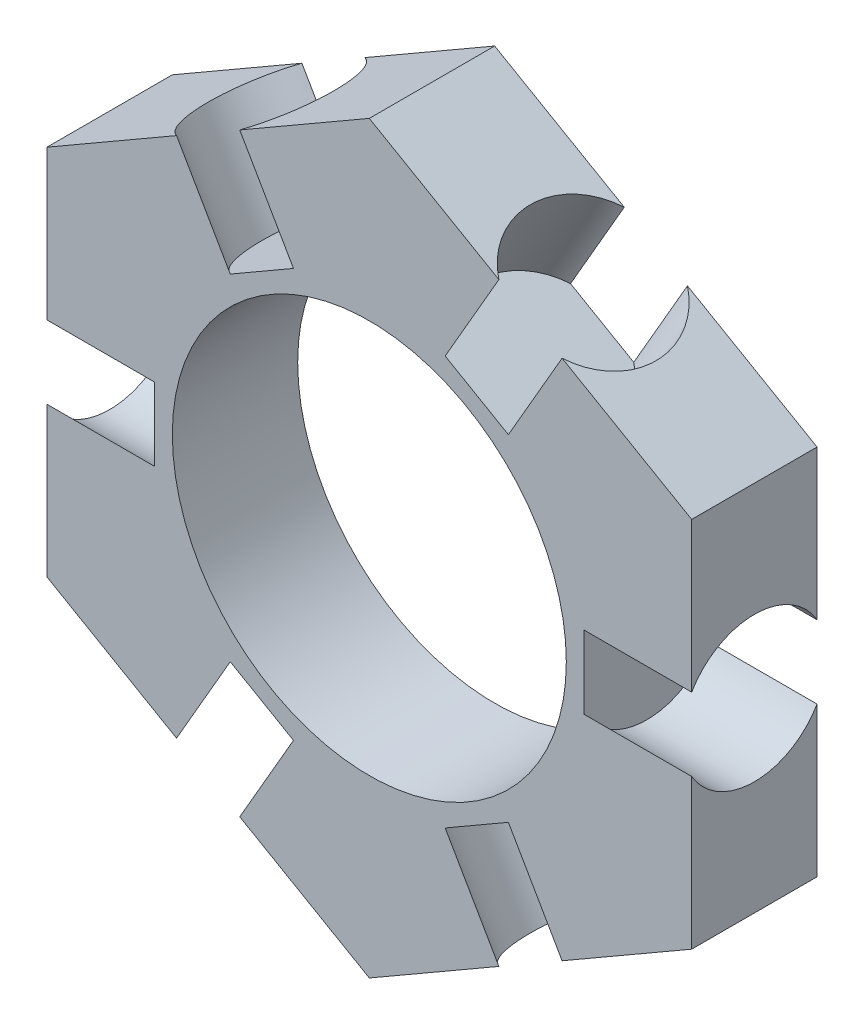
ISO-10303-21;
HEADER;
FILE_DESCRIPTION(('STEP AP214'),'2;1');
FILE_NAME('part.step','',(''),(''),'','','');
FILE_SCHEMA(('AUTOMOTIVE_DESIGN { 1 0 10303 214 1 1 1 1 }'));
ENDSEC;
DATA;
#1=APPLICATION_CONTEXT('core data for automotive mechanical design processes');
#2=APPLICATION_PROTOCOL_DEFINITION('international standard','automotive_design',2000,#1);
#3=PRODUCT_CONTEXT('',#1,'mechanical');
#4=PRODUCT('Part','Part','',(#3));
#5=PRODUCT_RELATED_PRODUCT_CATEGORY('part','',(#4));
#6=PRODUCT_DEFINITION_FORMATION('','',#4);
#7=PRODUCT_DEFINITION_CONTEXT('part definition',#1,'design');
#8=PRODUCT_DEFINITION('design','',#6,#7);
#9=PRODUCT_DEFINITION_SHAPE('','',#8);
#10=(LENGTH_UNIT() NAMED_UNIT(*) SI_UNIT(.MILLI.,.METRE.));
#11=(NAMED_UNIT(*) PLANE_ANGLE_UNIT() SI_UNIT($,.RADIAN.));
#12=(NAMED_UNIT(*) SI_UNIT($,.STERADIAN.) SOLID_ANGLE_UNIT());
#13=UNCERTAINTY_MEASURE_WITH_UNIT(LENGTH_MEASURE(1.E-05),#10,'distance_accuracy_value','');
#14=(GEOMETRIC_REPRESENTATION_CONTEXT(3) GLOBAL_UNCERTAINTY_ASSIGNED_CONTEXT((#13)) GLOBAL_UNIT_ASSIGNED_CONTEXT((#10,
#11,#12)) REPRESENTATION_CONTEXT('',''));
#15=CARTESIAN_POINT('',(0.,0.,0.));
#16=DIRECTION('',(0.,0.,1.));
#17=DIRECTION('',(1.,0.,0.));
#18=AXIS2_PLACEMENT_3D('',#15,#16,#17);
#19=CARTESIAN_POINT('',(0.,0.,3.5));
#20=DIRECTION('',(0.,0.,1.));
#21=DIRECTION('',(1.,0.,0.));
#22=AXIS2_PLACEMENT_3D('',#19,#20,#21);
#23=PLANE('',#22);
#24=CARTESIAN_POINT('',(0.,0.,3.5));
#25=DIRECTION('',(0.,0.,1.));
#26=DIRECTION('',(1.,0.,0.));
#27=AXIS2_PLACEMENT_3D('',#24,#25,#26);
#28=CIRCLE('',#27,11.);
#29=CARTESIAN_POINT('',(11.,0.,3.5));
#30=VERTEX_POINT('',#29);
#31=EDGE_CURVE('E364',#30,#30,#28,.T.);
#32=ORIENTED_EDGE('',*,*,#31,.F.);
#33=EDGE_LOOP('',(#32));
#34=FACE_BOUND('',#33,.T.);
#35=DIRECTION('',(0.866025403784439,0.5,0.));
#36=VECTOR('',#35,1.);
#37=CARTESIAN_POINT('',(0.,-20.7846096908265,3.5));
#38=LINE('',#37,#36);
#39=CARTESIAN_POINT('',(0.,-20.7846096908265,3.5));
#40=VERTEX_POINT('',#39);
#41=CARTESIAN_POINT('',(7.23524080962875,-16.6073414617356,3.5));
#42=VERTEX_POINT('',#41);
#43=EDGE_CURVE('E372',#40,#42,#38,.T.);
#44=ORIENTED_EDGE('',*,*,#43,.T.);
#45=DIRECTION('',(0.500000000000002,-0.866025403784437,0.));
#46=VECTOR('',#45,1.);
#47=CARTESIAN_POINT('',(4.23524080962874,-11.411189039029,3.5));
#48=LINE('',#47,#46);
#49=CARTESIAN_POINT('',(4.23524080962874,-11.411189039029,3.5));
#50=VERTEX_POINT('',#49);
#51=EDGE_CURVE('E61',#42,#50,#48,.F.);
#52=ORIENTED_EDGE('',*,*,#51,.T.);
#53=DIRECTION('',(-0.866025403784437,-0.500000000000002,0.));
#54=VECTOR('',#53,1.);
#55=CARTESIAN_POINT('',(6.00000000000003,-10.3923048454133,3.5));
#56=LINE('',#55,#54);
#57=CARTESIAN_POINT('',(7.76475919037136,-9.3734206517975,3.5));
#58=VERTEX_POINT('',#57);
#59=EDGE_CURVE('E338',#58,#50,#56,.T.);
#60=ORIENTED_EDGE('',*,*,#59,.F.);
#61=DIRECTION('',(0.500000000000002,-0.866025403784437,0.));
#62=VECTOR('',#61,1.);
#63=CARTESIAN_POINT('',(7.76475919037136,-9.3734206517975,3.5));
#64=LINE('',#63,#62);
#65=CARTESIAN_POINT('',(10.7647591903714,-14.5695730745041,3.5));
#66=VERTEX_POINT('',#65);
#67=EDGE_CURVE('E324',#58,#66,#64,.T.);
#68=ORIENTED_EDGE('',*,*,#67,.T.);
#69=CARTESIAN_POINT('',(18.,-10.3923048454133,3.5));
#70=VERTEX_POINT('',#69);
#71=EDGE_CURVE('E376',#66,#70,#38,.T.);
#72=ORIENTED_EDGE('',*,*,#71,.T.);
#73=DIRECTION('',(0.,1.,0.));
#74=VECTOR('',#73,1.);
#75=CARTESIAN_POINT('',(18.,-10.3923048454133,3.5));
#76=LINE('',#75,#74);
#77=CARTESIAN_POINT('',(18.,-2.03776838723137,3.5));
#78=VERTEX_POINT('',#77);
#79=EDGE_CURVE('E377',#70,#78,#76,.T.);
#80=ORIENTED_EDGE('',*,*,#79,.T.);
#81=DIRECTION('',(1.,0.,0.));
#82=VECTOR('',#81,1.);
#83=CARTESIAN_POINT('',(12.,-2.0377683872314,3.5));
#84=LINE('',#83,#82);
#85=CARTESIAN_POINT('',(12.,-2.0377683872314,3.5));
#86=VERTEX_POINT('',#85);
#87=EDGE_CURVE('E69',#78,#86,#84,.F.);
#88=ORIENTED_EDGE('',*,*,#87,.T.);
#89=DIRECTION('',(0.,-1.,0.));
#90=VECTOR('',#89,1.);
#91=CARTESIAN_POINT('',(12.,0.,3.5));
#92=LINE('',#91,#90);
#93=CARTESIAN_POINT('',(12.,2.03776838723156,3.5));
#94=VERTEX_POINT('',#93);
#95=EDGE_CURVE('E335',#94,#86,#92,.T.);
#96=ORIENTED_EDGE('',*,*,#95,.F.);
#97=DIRECTION('',(1.,0.,0.));
#98=VECTOR('',#97,1.);
#99=CARTESIAN_POINT('',(12.,2.03776838723157,3.5));
#100=LINE('',#99,#98);
#101=CARTESIAN_POINT('',(18.,2.0377683872316,3.5));
#102=VERTEX_POINT('',#101);
#103=EDGE_CURVE('E312',#94,#102,#100,.T.);
#104=ORIENTED_EDGE('',*,*,#103,.T.);
#105=CARTESIAN_POINT('',(18.,10.3923048454133,3.5));
#106=VERTEX_POINT('',#105);
#107=EDGE_CURVE('E375',#102,#106,#76,.T.);
#108=ORIENTED_EDGE('',*,*,#107,.T.);
#109=DIRECTION('',(-0.866025403784439,0.5,0.));
#110=VECTOR('',#109,1.);
#111=CARTESIAN_POINT('',(18.,10.3923048454133,3.5));
#112=LINE('',#111,#110);
#113=CARTESIAN_POINT('',(10.7647591903713,14.5695730745042,3.5));
#114=VERTEX_POINT('',#113);
#115=EDGE_CURVE('E382',#106,#114,#112,.T.);
#116=ORIENTED_EDGE('',*,*,#115,.T.);
#117=DIRECTION('',(0.5,0.866025403784439,0.));
#118=VECTOR('',#117,1.);
#119=CARTESIAN_POINT('',(7.76475919037129,9.37342065179754,3.5));
#120=LINE('',#119,#118);
#121=CARTESIAN_POINT('',(7.76475919037129,9.37342065179754,3.5));
#122=VERTEX_POINT('',#121);
#123=EDGE_CURVE('E302',#114,#122,#120,.F.);
#124=ORIENTED_EDGE('',*,*,#123,.T.);
#125=DIRECTION('',(0.866025403784439,-0.5,0.));
#126=VECTOR('',#125,1.);
#127=CARTESIAN_POINT('',(6.,10.3923048454133,3.5));
#128=LINE('',#127,#126);
#129=CARTESIAN_POINT('',(4.23524080962867,11.411189039029,3.5));
#130=VERTEX_POINT('',#129);
#131=EDGE_CURVE('E332',#130,#122,#128,.T.);
#132=ORIENTED_EDGE('',*,*,#131,.F.);
#133=DIRECTION('',(0.5,0.866025403784439,0.));
#134=VECTOR('',#133,1.);
#135=CARTESIAN_POINT('',(4.23524080962867,11.411189039029,3.5));
#136=LINE('',#135,#134);
#137=CARTESIAN_POINT('',(7.23524080962867,16.6073414617357,3.5));
#138=VERTEX_POINT('',#137);
#139=EDGE_CURVE('E298',#130,#138,#136,.T.);
#140=ORIENTED_EDGE('',*,*,#139,.T.);
#141=CARTESIAN_POINT('',(0.,20.7846096908265,3.5));
#142=VERTEX_POINT('',#141);
#143=EDGE_CURVE('E381',#138,#142,#112,.T.);
#144=ORIENTED_EDGE('',*,*,#143,.T.);
#145=DIRECTION('',(-0.866025403784439,-0.5,0.));
#146=VECTOR('',#145,1.);
#147=CARTESIAN_POINT('',(0.,20.7846096908265,3.5));
#148=LINE('',#147,#146);
#149=CARTESIAN_POINT('',(-7.23524080962886,16.6073414617355,3.5));
#150=VERTEX_POINT('',#149);
#151=EDGE_CURVE('E387',#142,#150,#148,.T.);
#152=ORIENTED_EDGE('',*,*,#151,.T.);
#153=DIRECTION('',(-0.500000000000008,0.866025403784434,0.));
#154=VECTOR('',#153,1.);
#155=CARTESIAN_POINT('',(-4.23524080962882,11.411189039029,3.5));
#156=LINE('',#155,#154);
#157=CARTESIAN_POINT('',(-4.23524080962882,11.411189039029,3.5));
#158=VERTEX_POINT('',#157);
#159=EDGE_CURVE('E288',#150,#158,#156,.F.);
#160=ORIENTED_EDGE('',*,*,#159,.T.);
#161=DIRECTION('',(0.866025403784434,0.500000000000008,0.));
#162=VECTOR('',#161,1.);
#163=CARTESIAN_POINT('',(-6.0000000000001,10.3923048454132,3.5));
#164=LINE('',#163,#162);
#165=CARTESIAN_POINT('',(-7.76475919037142,9.37342065179744,3.5));
#166=VERTEX_POINT('',#165);
#167=EDGE_CURVE('E257',#166,#158,#164,.T.);
#168=ORIENTED_EDGE('',*,*,#167,.F.);
#169=DIRECTION('',(-0.500000000000008,0.866025403784434,0.));
#170=VECTOR('',#169,1.);
#171=CARTESIAN_POINT('',(-7.76475919037142,9.37342065179744,3.5));
#172=LINE('',#171,#170);
#173=CARTESIAN_POINT('',(-10.7647591903715,14.569573074504,3.5));
#174=VERTEX_POINT('',#173);
#175=EDGE_CURVE('E284',#166,#174,#172,.T.);
#176=ORIENTED_EDGE('',*,*,#175,.T.);
#177=CARTESIAN_POINT('',(-18.,10.3923048454133,3.5));
#178=VERTEX_POINT('',#177);
#179=EDGE_CURVE('E386',#174,#178,#148,.T.);
#180=ORIENTED_EDGE('',*,*,#179,.T.);
#181=DIRECTION('',(0.,-1.,0.));
#182=VECTOR('',#181,1.);
#183=CARTESIAN_POINT('',(-18.,10.3923048454133,3.5));
#184=LINE('',#183,#182);
#185=CARTESIAN_POINT('',(-18.,2.03776838723125,3.5));
#186=VERTEX_POINT('',#185);
#187=EDGE_CURVE('E270',#178,#186,#184,.T.);
#188=ORIENTED_EDGE('',*,*,#187,.T.);
#189=DIRECTION('',(-1.,0.,0.));
#190=VECTOR('',#189,1.);
#191=CARTESIAN_POINT('',(-12.,2.03776838723132,3.5));
#192=LINE('',#191,#190);
#193=CARTESIAN_POINT('',(-12.,2.03776838723132,3.5));
#194=VERTEX_POINT('',#193);
#195=EDGE_CURVE('E261',#186,#194,#192,.F.);
#196=ORIENTED_EDGE('',*,*,#195,.T.);
#197=DIRECTION('',(0.,1.,0.));
#198=VECTOR('',#197,1.);
#199=CARTESIAN_POINT('',(-12.,-1.4255263636187E-13,3.5));
#200=LINE('',#199,#198);
#201=CARTESIAN_POINT('',(-12.,-2.03776838723165,3.5));
#202=VERTEX_POINT('',#201);
#203=EDGE_CURVE('E246',#202,#194,#200,.T.);
#204=ORIENTED_EDGE('',*,*,#203,.F.);
#205=DIRECTION('',(-1.,0.,0.));
#206=VECTOR('',#205,1.);
#207=CARTESIAN_POINT('',(-12.,-2.03776838723165,3.5));
#208=LINE('',#207,#206);
#209=CARTESIAN_POINT('',(-18.,-2.03776838723172,3.5));
#210=VERTEX_POINT('',#209);
#211=EDGE_CURVE('E273',#202,#210,#208,.T.);
#212=ORIENTED_EDGE('',*,*,#211,.T.);
#213=CARTESIAN_POINT('',(-18.,-10.3923048454133,3.5));
#214=VERTEX_POINT('',#213);
#215=EDGE_CURVE('E391',#210,#214,#184,.T.);
#216=ORIENTED_EDGE('',*,*,#215,.T.);
#217=DIRECTION('',(0.866025403784439,-0.5,0.));
#218=VECTOR('',#217,1.);
#219=CARTESIAN_POINT('',(-18.,-10.3923048454133,3.5));
#220=LINE('',#219,#218);
#221=CARTESIAN_POINT('',(-10.7647591903713,-14.5695730745042,3.5));
#222=VERTEX_POINT('',#221);
#223=EDGE_CURVE('E395',#214,#222,#220,.T.);
#224=ORIENTED_EDGE('',*,*,#223,.T.);
#225=DIRECTION('',(-0.5,-0.866025403784439,0.));
#226=VECTOR('',#225,1.);
#227=CARTESIAN_POINT('',(-7.76475919037129,-9.37342065179754,3.5));
#228=LINE('',#227,#226);
#229=CARTESIAN_POINT('',(-7.76475919037129,-9.37342065179754,3.5));
#230=VERTEX_POINT('',#229);
#231=EDGE_CURVE('E356',#222,#230,#228,.F.);
#232=ORIENTED_EDGE('',*,*,#231,.T.);
#233=DIRECTION('',(-0.866025403784439,0.5,0.));
#234=VECTOR('',#233,1.);
#235=CARTESIAN_POINT('',(-6.,-10.3923048454133,3.5));
#236=LINE('',#235,#234);
#237=CARTESIAN_POINT('',(-4.23524080962867,-11.411189039029,3.5));
#238=VERTEX_POINT('',#237);
#239=EDGE_CURVE('E360',#238,#230,#236,.T.);
#240=ORIENTED_EDGE('',*,*,#239,.F.);
#241=DIRECTION('',(-0.5,-0.866025403784439,0.));
#242=VECTOR('',#241,1.);
#243=CARTESIAN_POINT('',(-4.23524080962867,-11.411189039029,3.5));
#244=LINE('',#243,#242);
#245=CARTESIAN_POINT('',(-7.23524080962867,-16.6073414617357,3.5));
#246=VERTEX_POINT('',#245);
#247=EDGE_CURVE('E352',#238,#246,#244,.T.);
#248=ORIENTED_EDGE('',*,*,#247,.T.);
#249=EDGE_CURVE('E394',#246,#40,#220,.T.);
#250=ORIENTED_EDGE('',*,*,#249,.T.);
#251=EDGE_LOOP('',(#44,#52,#60,#68,#72,#80,#88,#96,#104,#108,#116,#124,#132,#140,#144,#152,#160,
#168,#176,#180,#188,#196,#204,#212,#216,#224,#232,#240,#248,#250));
#252=FACE_BOUND('',#251,.T.);
#253=ADVANCED_FACE('F45',(#34,#252),#23,.T.);
#254=CARTESIAN_POINT('',(0.,0.,-3.5));
#255=DIRECTION('',(0.,0.,1.));
#256=DIRECTION('',(1.,0.,0.));
#257=AXIS2_PLACEMENT_3D('',#254,#255,#256);
#258=PLANE('',#257);
#259=CARTESIAN_POINT('',(0.,0.,-3.5));
#260=DIRECTION('',(0.,0.,1.));
#261=DIRECTION('',(1.,0.,0.));
#262=AXIS2_PLACEMENT_3D('',#259,#260,#261);
#263=CIRCLE('',#262,11.);
#264=CARTESIAN_POINT('',(11.,0.,-3.5));
#265=VERTEX_POINT('',#264);
#266=EDGE_CURVE('E363',#265,#265,#263,.T.);
#267=ORIENTED_EDGE('',*,*,#266,.T.);
#268=EDGE_LOOP('',(#267));
#269=FACE_BOUND('',#268,.T.);
#270=DIRECTION('',(0.500000000000002,-0.866025403784437,0.));
#271=VECTOR('',#270,1.);
#272=CARTESIAN_POINT('',(4.23524080962874,-11.411189039029,-3.5));
#273=LINE('',#272,#271);
#274=CARTESIAN_POINT('',(7.23524080962876,-16.6073414617356,-3.5));
#275=VERTEX_POINT('',#274);
#276=CARTESIAN_POINT('',(4.23524080962874,-11.411189039029,-3.5));
#277=VERTEX_POINT('',#276);
#278=EDGE_CURVE('E321',#275,#277,#273,.F.);
#279=ORIENTED_EDGE('',*,*,#278,.F.);
#280=DIRECTION('',(0.866025403784439,0.5,0.));
#281=VECTOR('',#280,1.);
#282=CARTESIAN_POINT('',(0.,-20.7846096908265,-3.5));
#283=LINE('',#282,#281);
#284=CARTESIAN_POINT('',(0.,-20.7846096908265,-3.5));
#285=VERTEX_POINT('',#284);
#286=EDGE_CURVE('E400',#285,#275,#283,.T.);
#287=ORIENTED_EDGE('',*,*,#286,.F.);
#288=DIRECTION('',(0.866025403784439,-0.5,0.));
#289=VECTOR('',#288,1.);
#290=CARTESIAN_POINT('',(-18.,-10.3923048454133,-3.5));
#291=LINE('',#290,#289);
#292=CARTESIAN_POINT('',(-7.23524080962867,-16.6073414617357,-3.5));
#293=VERTEX_POINT('',#292);
#294=EDGE_CURVE('E424',#293,#285,#291,.T.);
#295=ORIENTED_EDGE('',*,*,#294,.F.);
#296=DIRECTION('',(-0.5,-0.866025403784439,0.));
#297=VECTOR('',#296,1.);
#298=CARTESIAN_POINT('',(-4.23524080962867,-11.411189039029,-3.5));
#299=LINE('',#298,#297);
#300=CARTESIAN_POINT('',(-4.23524080962867,-11.411189039029,-3.5));
#301=VERTEX_POINT('',#300);
#302=EDGE_CURVE('E346',#301,#293,#299,.T.);
#303=ORIENTED_EDGE('',*,*,#302,.F.);
#304=DIRECTION('',(-0.866025403784439,0.5,0.));
#305=VECTOR('',#304,1.);
#306=CARTESIAN_POINT('',(-6.,-10.3923048454133,-3.5));
#307=LINE('',#306,#305);
#308=CARTESIAN_POINT('',(-7.76475919037129,-9.37342065179754,-3.5));
#309=VERTEX_POINT('',#308);
#310=EDGE_CURVE('E456',#301,#309,#307,.T.);
#311=ORIENTED_EDGE('',*,*,#310,.T.);
#312=DIRECTION('',(-0.5,-0.866025403784439,0.));
#313=VECTOR('',#312,1.);
#314=CARTESIAN_POINT('',(-7.76475919037129,-9.37342065179754,-3.5));
#315=LINE('',#314,#313);
#316=CARTESIAN_POINT('',(-10.7647591903713,-14.5695730745042,-3.5));
#317=VERTEX_POINT('',#316);
#318=EDGE_CURVE('E349',#317,#309,#315,.F.);
#319=ORIENTED_EDGE('',*,*,#318,.F.);
#320=CARTESIAN_POINT('',(-18.,-10.3923048454133,-3.5));
#321=VERTEX_POINT('',#320);
#322=EDGE_CURVE('E425',#321,#317,#291,.T.);
#323=ORIENTED_EDGE('',*,*,#322,.F.);
#324=DIRECTION('',(0.,-1.,0.));
#325=VECTOR('',#324,1.);
#326=CARTESIAN_POINT('',(-18.,10.3923048454133,-3.5));
#327=LINE('',#326,#325);
#328=CARTESIAN_POINT('',(-18.,-2.03776838723172,-3.5));
#329=VERTEX_POINT('',#328);
#330=EDGE_CURVE('E419',#329,#321,#327,.T.);
#331=ORIENTED_EDGE('',*,*,#330,.F.);
#332=DIRECTION('',(-1.,0.,0.));
#333=VECTOR('',#332,1.);
#334=CARTESIAN_POINT('',(-12.,-2.03776838723165,-3.5));
#335=LINE('',#334,#333);
#336=CARTESIAN_POINT('',(-12.,-2.03776838723165,-3.5));
#337=VERTEX_POINT('',#336);
#338=EDGE_CURVE('E528',#337,#329,#335,.T.);
#339=ORIENTED_EDGE('',*,*,#338,.F.);
#340=DIRECTION('',(0.,1.,0.));
#341=VECTOR('',#340,1.);
#342=CARTESIAN_POINT('',(-12.,-1.4255263636187E-13,-3.5));
#343=LINE('',#342,#341);
#344=CARTESIAN_POINT('',(-12.,2.03776838723132,-3.5));
#345=VERTEX_POINT('',#344);
#346=EDGE_CURVE('E480',#337,#345,#343,.T.);
#347=ORIENTED_EDGE('',*,*,#346,.T.);
#348=DIRECTION('',(-1.,0.,0.));
#349=VECTOR('',#348,1.);
#350=CARTESIAN_POINT('',(-12.,2.03776838723132,-3.5));
#351=LINE('',#350,#349);
#352=CARTESIAN_POINT('',(-18.,2.03776838723125,-3.5));
#353=VERTEX_POINT('',#352);
#354=EDGE_CURVE('E264',#353,#345,#351,.F.);
#355=ORIENTED_EDGE('',*,*,#354,.F.);
#356=CARTESIAN_POINT('',(-18.,10.3923048454133,-3.5));
#357=VERTEX_POINT('',#356);
#358=EDGE_CURVE('E420',#357,#353,#327,.T.);
#359=ORIENTED_EDGE('',*,*,#358,.F.);
#360=DIRECTION('',(-0.866025403784439,-0.5,0.));
#361=VECTOR('',#360,1.);
#362=CARTESIAN_POINT('',(0.,20.7846096908265,-3.5));
#363=LINE('',#362,#361);
#364=CARTESIAN_POINT('',(-10.7647591903715,14.569573074504,-3.5));
#365=VERTEX_POINT('',#364);
#366=EDGE_CURVE('E414',#365,#357,#363,.T.);
#367=ORIENTED_EDGE('',*,*,#366,.F.);
#368=DIRECTION('',(-0.500000000000008,0.866025403784434,0.));
#369=VECTOR('',#368,1.);
#370=CARTESIAN_POINT('',(-7.76475919037142,9.37342065179744,-3.5));
#371=LINE('',#370,#369);
#372=CARTESIAN_POINT('',(-7.76475919037142,9.37342065179744,-3.5));
#373=VERTEX_POINT('',#372);
#374=EDGE_CURVE('E272',#373,#365,#371,.T.);
#375=ORIENTED_EDGE('',*,*,#374,.F.);
#376=DIRECTION('',(0.866025403784434,0.500000000000008,0.));
#377=VECTOR('',#376,1.);
#378=CARTESIAN_POINT('',(-6.0000000000001,10.3923048454132,-3.5));
#379=LINE('',#378,#377);
#380=CARTESIAN_POINT('',(-4.23524080962882,11.411189039029,-3.5));
#381=VERTEX_POINT('',#380);
#382=EDGE_CURVE('E483',#373,#381,#379,.T.);
#383=ORIENTED_EDGE('',*,*,#382,.T.);
#384=DIRECTION('',(-0.500000000000008,0.866025403784434,0.));
#385=VECTOR('',#384,1.);
#386=CARTESIAN_POINT('',(-4.23524080962882,11.411189039029,-3.5));
#387=LINE('',#386,#385);
#388=CARTESIAN_POINT('',(-7.23524080962887,16.6073414617356,-3.5));
#389=VERTEX_POINT('',#388);
#390=EDGE_CURVE('E277',#389,#381,#387,.F.);
#391=ORIENTED_EDGE('',*,*,#390,.F.);
#392=CARTESIAN_POINT('',(0.,20.7846096908265,-3.5));
#393=VERTEX_POINT('',#392);
#394=EDGE_CURVE('E415',#393,#389,#363,.T.);
#395=ORIENTED_EDGE('',*,*,#394,.F.);
#396=DIRECTION('',(-0.866025403784439,0.5,0.));
#397=VECTOR('',#396,1.);
#398=CARTESIAN_POINT('',(18.,10.3923048454133,-3.5));
#399=LINE('',#398,#397);
#400=CARTESIAN_POINT('',(7.23524080962867,16.6073414617357,-3.5));
#401=VERTEX_POINT('',#400);
#402=EDGE_CURVE('E409',#401,#393,#399,.T.);
#403=ORIENTED_EDGE('',*,*,#402,.F.);
#404=DIRECTION('',(0.5,0.866025403784439,0.));
#405=VECTOR('',#404,1.);
#406=CARTESIAN_POINT('',(4.23524080962867,11.411189039029,-3.5));
#407=LINE('',#406,#405);
#408=CARTESIAN_POINT('',(4.23524080962867,11.411189039029,-3.5));
#409=VERTEX_POINT('',#408);
#410=EDGE_CURVE('E292',#409,#401,#407,.T.);
#411=ORIENTED_EDGE('',*,*,#410,.F.);
#412=DIRECTION('',(0.866025403784439,-0.5,0.));
#413=VECTOR('',#412,1.);
#414=CARTESIAN_POINT('',(6.,10.3923048454133,-3.5));
#415=LINE('',#414,#413);
#416=CARTESIAN_POINT('',(7.76475919037129,9.37342065179754,-3.5));
#417=VERTEX_POINT('',#416);
#418=EDGE_CURVE('E487',#409,#417,#415,.T.);
#419=ORIENTED_EDGE('',*,*,#418,.T.);
#420=DIRECTION('',(0.5,0.866025403784439,0.));
#421=VECTOR('',#420,1.);
#422=CARTESIAN_POINT('',(7.76475919037129,9.37342065179754,-3.5));
#423=LINE('',#422,#421);
#424=CARTESIAN_POINT('',(10.7647591903713,14.5695730745042,-3.5));
#425=VERTEX_POINT('',#424);
#426=EDGE_CURVE('E295',#425,#417,#423,.F.);
#427=ORIENTED_EDGE('',*,*,#426,.F.);
#428=CARTESIAN_POINT('',(18.,10.3923048454133,-3.5));
#429=VERTEX_POINT('',#428);
#430=EDGE_CURVE('E410',#429,#425,#399,.T.);
#431=ORIENTED_EDGE('',*,*,#430,.F.);
#432=DIRECTION('',(0.,1.,0.));
#433=VECTOR('',#432,1.);
#434=CARTESIAN_POINT('',(18.,-10.3923048454133,-3.5));
#435=LINE('',#434,#433);
#436=CARTESIAN_POINT('',(18.,2.0377683872316,-3.5));
#437=VERTEX_POINT('',#436);
#438=EDGE_CURVE('E404',#437,#429,#435,.T.);
#439=ORIENTED_EDGE('',*,*,#438,.F.);
#440=DIRECTION('',(1.,0.,0.));
#441=VECTOR('',#440,1.);
#442=CARTESIAN_POINT('',(12.,2.03776838723157,-3.5));
#443=LINE('',#442,#441);
#444=CARTESIAN_POINT('',(12.,2.03776838723156,-3.5));
#445=VERTEX_POINT('',#444);
#446=EDGE_CURVE('E306',#445,#437,#443,.T.);
#447=ORIENTED_EDGE('',*,*,#446,.F.);
#448=DIRECTION('',(0.,-1.,0.));
#449=VECTOR('',#448,1.);
#450=CARTESIAN_POINT('',(12.,0.,-3.5));
#451=LINE('',#450,#449);
#452=CARTESIAN_POINT('',(12.,-2.0377683872314,-3.5));
#453=VERTEX_POINT('',#452);
#454=EDGE_CURVE('E54',#445,#453,#451,.T.);
#455=ORIENTED_EDGE('',*,*,#454,.T.);
#456=DIRECTION('',(1.,0.,0.));
#457=VECTOR('',#456,1.);
#458=CARTESIAN_POINT('',(12.,-2.0377683872314,-3.5));
#459=LINE('',#458,#457);
#460=CARTESIAN_POINT('',(18.,-2.03776838723137,-3.5));
#461=VERTEX_POINT('',#460);
#462=EDGE_CURVE('E309',#461,#453,#459,.F.);
#463=ORIENTED_EDGE('',*,*,#462,.F.);
#464=CARTESIAN_POINT('',(18.,-10.3923048454133,-3.5));
#465=VERTEX_POINT('',#464);
#466=EDGE_CURVE('E405',#465,#461,#435,.T.);
#467=ORIENTED_EDGE('',*,*,#466,.F.);
#468=CARTESIAN_POINT('',(10.7647591903714,-14.5695730745041,-3.5));
#469=VERTEX_POINT('',#468);
#470=EDGE_CURVE('E368',#469,#465,#283,.T.);
#471=ORIENTED_EDGE('',*,*,#470,.F.);
#472=DIRECTION('',(0.500000000000002,-0.866025403784437,0.));
#473=VECTOR('',#472,1.);
#474=CARTESIAN_POINT('',(7.76475919037136,-9.3734206517975,-3.5));
#475=LINE('',#474,#473);
#476=CARTESIAN_POINT('',(7.76475919037136,-9.3734206517975,-3.5));
#477=VERTEX_POINT('',#476);
#478=EDGE_CURVE('E318',#477,#469,#475,.T.);
#479=ORIENTED_EDGE('',*,*,#478,.F.);
#480=DIRECTION('',(-0.866025403784437,-0.500000000000002,0.));
#481=VECTOR('',#480,1.);
#482=CARTESIAN_POINT('',(6.00000000000003,-10.3923048454133,-3.5));
#483=LINE('',#482,#481);
#484=EDGE_CURVE('E11',#477,#277,#483,.T.);
#485=ORIENTED_EDGE('',*,*,#484,.T.);
#486=EDGE_LOOP('',(#279,#287,#295,#303,#311,#319,#323,#331,#339,#347,#355,#359,#367,#375,#383,
#391,#395,#403,#411,#419,#427,#431,#439,#447,#455,#463,#467,#471,#479,#485));
#487=FACE_BOUND('',#486,.T.);
#488=ADVANCED_FACE('F496',(#269,#487),#258,.F.);
#489=CARTESIAN_POINT('',(0.,-20.7846096908265,3.5));
#490=DIRECTION('',(-0.5,0.866025403784439,0.));
#491=DIRECTION('',(-0.866025403784439,-0.5,0.));
#492=AXIS2_PLACEMENT_3D('',#489,#490,#491);
#493=PLANE('',#492);
#494=CARTESIAN_POINT('',(9.00000000000006,-15.5884572681199,0.));
#495=DIRECTION('',(-0.5,0.866025403784439,0.));
#496=DIRECTION('',(-0.866025403784439,-0.5,0.));
#497=AXIS2_PLACEMENT_3D('',#494,#495,#496);
#498=CIRCLE('',#497,4.05);
#499=EDGE_CURVE('E479',#469,#66,#498,.F.);
#500=ORIENTED_EDGE('',*,*,#499,.F.);
#501=ORIENTED_EDGE('',*,*,#470,.T.);
#502=DIRECTION('',(0.,0.,-1.));
#503=VECTOR('',#502,1.);
#504=CARTESIAN_POINT('',(18.,-10.3923048454133,3.5));
#505=LINE('',#504,#503);
#506=EDGE_CURVE('E448',#70,#465,#505,.T.);
#507=ORIENTED_EDGE('',*,*,#506,.F.);
#508=ORIENTED_EDGE('',*,*,#71,.F.);
#509=EDGE_LOOP('',(#500,#501,#507,#508));
#510=FACE_BOUND('',#509,.T.);
#511=ADVANCED_FACE('F590',(#510),#493,.F.);
#512=CARTESIAN_POINT('',(18.,-10.3923048454133,3.5));
#513=DIRECTION('',(-1.,0.,0.));
#514=DIRECTION('',(0.,-1.,0.));
#515=AXIS2_PLACEMENT_3D('',#512,#513,#514);
#516=PLANE('',#515);
#517=CARTESIAN_POINT('',(18.,1.11022302462516E-13,0.));
#518=DIRECTION('',(-1.,0.,0.));
#519=DIRECTION('',(0.,-1.,0.));
#520=AXIS2_PLACEMENT_3D('',#517,#518,#519);
#521=CIRCLE('',#520,4.05);
#522=EDGE_CURVE('E475',#437,#102,#521,.F.);
#523=ORIENTED_EDGE('',*,*,#522,.F.);
#524=ORIENTED_EDGE('',*,*,#438,.T.);
#525=DIRECTION('',(0.,0.,-1.));
#526=VECTOR('',#525,1.);
#527=CARTESIAN_POINT('',(18.,10.3923048454133,3.5));
#528=LINE('',#527,#526);
#529=EDGE_CURVE('E444',#106,#429,#528,.T.);
#530=ORIENTED_EDGE('',*,*,#529,.F.);
#531=ORIENTED_EDGE('',*,*,#107,.F.);
#532=EDGE_LOOP('',(#523,#524,#530,#531));
#533=FACE_BOUND('',#532,.T.);
#534=ADVANCED_FACE('F566',(#533),#516,.F.);
#535=CARTESIAN_POINT('',(18.,10.3923048454133,3.5));
#536=DIRECTION('',(-0.5,-0.866025403784439,0.));
#537=DIRECTION('',(0.866025403784439,-0.5,0.));
#538=AXIS2_PLACEMENT_3D('',#535,#536,#537);
#539=PLANE('',#538);
#540=CARTESIAN_POINT('',(8.99999999999998,15.5884572681199,0.));
#541=DIRECTION('',(-0.5,-0.866025403784439,0.));
#542=DIRECTION('',(0.866025403784439,-0.5,0.));
#543=AXIS2_PLACEMENT_3D('',#540,#541,#542);
#544=CIRCLE('',#543,4.05);
#545=EDGE_CURVE('E471',#401,#138,#544,.F.);
#546=ORIENTED_EDGE('',*,*,#545,.F.);
#547=ORIENTED_EDGE('',*,*,#402,.T.);
#548=DIRECTION('',(0.,0.,-1.));
#549=VECTOR('',#548,1.);
#550=CARTESIAN_POINT('',(0.,20.7846096908265,3.5));
#551=LINE('',#550,#549);
#552=EDGE_CURVE('E440',#142,#393,#551,.T.);
#553=ORIENTED_EDGE('',*,*,#552,.F.);
#554=ORIENTED_EDGE('',*,*,#143,.F.);
#555=EDGE_LOOP('',(#546,#547,#553,#554));
#556=FACE_BOUND('',#555,.T.);
#557=ADVANCED_FACE('F596',(#556),#539,.F.);
#558=CARTESIAN_POINT('',(0.,20.7846096908265,3.5));
#559=DIRECTION('',(0.5,-0.866025403784439,0.));
#560=DIRECTION('',(0.866025403784439,0.5,0.));
#561=AXIS2_PLACEMENT_3D('',#558,#559,#560);
#562=PLANE('',#561);
#563=CARTESIAN_POINT('',(-9.00000000000017,15.5884572681198,0.));
#564=DIRECTION('',(0.5,-0.866025403784439,0.));
#565=DIRECTION('',(0.866025403784439,0.5,0.));
#566=AXIS2_PLACEMENT_3D('',#563,#564,#565);
#567=CIRCLE('',#566,4.05);
#568=EDGE_CURVE('E467',#365,#174,#567,.F.);
#569=ORIENTED_EDGE('',*,*,#568,.F.);
#570=ORIENTED_EDGE('',*,*,#366,.T.);
#571=DIRECTION('',(0.,0.,-1.));
#572=VECTOR('',#571,1.);
#573=CARTESIAN_POINT('',(-18.,10.3923048454133,3.5));
#574=LINE('',#573,#572);
#575=EDGE_CURVE('E436',#178,#357,#574,.T.);
#576=ORIENTED_EDGE('',*,*,#575,.F.);
#577=ORIENTED_EDGE('',*,*,#179,.F.);
#578=EDGE_LOOP('',(#569,#570,#576,#577));
#579=FACE_BOUND('',#578,.T.);
#580=ADVANCED_FACE('F626',(#579),#562,.F.);
#581=CARTESIAN_POINT('',(-18.,10.3923048454133,3.5));
#582=DIRECTION('',(1.,0.,0.));
#583=DIRECTION('',(0.,0.,-1.));
#584=AXIS2_PLACEMENT_3D('',#581,#582,#583);
#585=PLANE('',#584);
#586=CARTESIAN_POINT('',(-18.,-2.37657116208823E-13,0.));
#587=DIRECTION('',(1.,0.,0.));
#588=DIRECTION('',(0.,0.,-1.));
#589=AXIS2_PLACEMENT_3D('',#586,#587,#588);
#590=CIRCLE('',#589,4.05);
#591=EDGE_CURVE('E463',#329,#210,#590,.F.);
#592=ORIENTED_EDGE('',*,*,#591,.F.);
#593=ORIENTED_EDGE('',*,*,#330,.T.);
#594=DIRECTION('',(0.,0.,-1.));
#595=VECTOR('',#594,1.);
#596=CARTESIAN_POINT('',(-18.,-10.3923048454133,3.5));
#597=LINE('',#596,#595);
#598=EDGE_CURVE('E432',#214,#321,#597,.T.);
#599=ORIENTED_EDGE('',*,*,#598,.F.);
#600=ORIENTED_EDGE('',*,*,#215,.F.);
#601=EDGE_LOOP('',(#592,#593,#599,#600));
#602=FACE_BOUND('',#601,.T.);
#603=ADVANCED_FACE('F622',(#602),#585,.F.);
#604=CARTESIAN_POINT('',(-18.,-10.3923048454133,3.5));
#605=DIRECTION('',(0.5,0.866025403784439,0.));
#606=DIRECTION('',(-0.866025403784439,0.5,0.));
#607=AXIS2_PLACEMENT_3D('',#604,#605,#606);
#608=PLANE('',#607);
#609=CARTESIAN_POINT('',(-8.99999999999998,-15.5884572681199,0.));
#610=DIRECTION('',(0.5,0.866025403784439,0.));
#611=DIRECTION('',(-0.866025403784439,0.5,0.));
#612=AXIS2_PLACEMENT_3D('',#609,#610,#611);
#613=CIRCLE('',#612,4.05);
#614=EDGE_CURVE('E455',#293,#246,#613,.F.);
#615=ORIENTED_EDGE('',*,*,#614,.F.);
#616=ORIENTED_EDGE('',*,*,#294,.T.);
#617=DIRECTION('',(0.,0.,-1.));
#618=VECTOR('',#617,1.);
#619=CARTESIAN_POINT('',(0.,-20.7846096908265,3.5));
#620=LINE('',#619,#618);
#621=EDGE_CURVE('E399',#40,#285,#620,.T.);
#622=ORIENTED_EDGE('',*,*,#621,.F.);
#623=ORIENTED_EDGE('',*,*,#249,.F.);
#624=EDGE_LOOP('',(#615,#616,#622,#623));
#625=FACE_BOUND('',#624,.T.);
#626=ADVANCED_FACE('F600',(#625),#608,.F.);
#627=EDGE_CURVE('E476',#42,#275,#498,.F.);
#628=ORIENTED_EDGE('',*,*,#627,.F.);
#629=ORIENTED_EDGE('',*,*,#43,.F.);
#630=ORIENTED_EDGE('',*,*,#621,.T.);
#631=ORIENTED_EDGE('',*,*,#286,.T.);
#632=EDGE_LOOP('',(#628,#629,#630,#631));
#633=FACE_BOUND('',#632,.T.);
#634=ADVANCED_FACE('F47',(#633),#493,.F.);
#635=EDGE_CURVE('E472',#78,#461,#521,.F.);
#636=ORIENTED_EDGE('',*,*,#635,.F.);
#637=ORIENTED_EDGE('',*,*,#79,.F.);
#638=ORIENTED_EDGE('',*,*,#506,.T.);
#639=ORIENTED_EDGE('',*,*,#466,.T.);
#640=EDGE_LOOP('',(#636,#637,#638,#639));
#641=FACE_BOUND('',#640,.T.);
#642=ADVANCED_FACE('F589',(#641),#516,.F.);
#643=EDGE_CURVE('E468',#114,#425,#544,.F.);
#644=ORIENTED_EDGE('',*,*,#643,.F.);
#645=ORIENTED_EDGE('',*,*,#115,.F.);
#646=ORIENTED_EDGE('',*,*,#529,.T.);
#647=ORIENTED_EDGE('',*,*,#430,.T.);
#648=EDGE_LOOP('',(#644,#645,#646,#647));
#649=FACE_BOUND('',#648,.T.);
#650=ADVANCED_FACE('F572',(#649),#539,.F.);
#651=EDGE_CURVE('E464',#150,#389,#567,.F.);
#652=ORIENTED_EDGE('',*,*,#651,.F.);
#653=ORIENTED_EDGE('',*,*,#151,.F.);
#654=ORIENTED_EDGE('',*,*,#552,.T.);
#655=ORIENTED_EDGE('',*,*,#394,.T.);
#656=EDGE_LOOP('',(#652,#653,#654,#655));
#657=FACE_BOUND('',#656,.T.);
#658=ADVANCED_FACE('F620',(#657),#562,.F.);
#659=EDGE_CURVE('E460',#186,#353,#590,.F.);
#660=ORIENTED_EDGE('',*,*,#659,.F.);
#661=ORIENTED_EDGE('',*,*,#187,.F.);
#662=ORIENTED_EDGE('',*,*,#575,.T.);
#663=ORIENTED_EDGE('',*,*,#358,.T.);
#664=EDGE_LOOP('',(#660,#661,#662,#663));
#665=FACE_BOUND('',#664,.T.);
#666=ADVANCED_FACE('F616',(#665),#585,.F.);
#667=EDGE_CURVE('E452',#222,#317,#613,.F.);
#668=ORIENTED_EDGE('',*,*,#667,.F.);
#669=ORIENTED_EDGE('',*,*,#223,.F.);
#670=ORIENTED_EDGE('',*,*,#598,.T.);
#671=ORIENTED_EDGE('',*,*,#322,.T.);
#672=EDGE_LOOP('',(#668,#669,#670,#671));
#673=FACE_BOUND('',#672,.T.);
#674=ADVANCED_FACE('F613',(#673),#608,.F.);
#675=CARTESIAN_POINT('',(0.,0.,3.5));
#676=DIRECTION('',(0.,0.,-1.));
#677=DIRECTION('',(-1.,0.,0.));
#678=AXIS2_PLACEMENT_3D('',#675,#676,#677);
#679=CYLINDRICAL_SURFACE('',#678,11.);
#680=ORIENTED_EDGE('',*,*,#31,.T.);
#681=EDGE_LOOP('',(#680));
#682=FACE_BOUND('',#681,.T.);
#683=ORIENTED_EDGE('',*,*,#266,.F.);
#684=EDGE_LOOP('',(#683));
#685=FACE_BOUND('',#684,.T.);
#686=ADVANCED_FACE('F610',(#682,#685),#679,.F.);
#687=CARTESIAN_POINT('',(-5.99999999999998,-10.3923048454133,0.));
#688=DIRECTION('',(0.5,0.866025403784439,0.));
#689=DIRECTION('',(-0.866025403784439,0.5,0.));
#690=AXIS2_PLACEMENT_3D('',#687,#688,#689);
#691=PLANE('',#690);
#692=ORIENTED_EDGE('',*,*,#239,.T.);
#693=CARTESIAN_POINT('',(-5.99999999999998,-10.3923048454133,0.));
#694=DIRECTION('',(0.5,0.866025403784439,0.));
#695=DIRECTION('',(-0.866025403784439,0.5,0.));
#696=AXIS2_PLACEMENT_3D('',#693,#694,#695);
#697=CIRCLE('',#696,4.05);
#698=EDGE_CURVE('E341',#309,#230,#697,.T.);
#699=ORIENTED_EDGE('',*,*,#698,.F.);
#700=ORIENTED_EDGE('',*,*,#310,.F.);
#701=EDGE_CURVE('E345',#238,#301,#697,.T.);
#702=ORIENTED_EDGE('',*,*,#701,.F.);
#703=EDGE_LOOP('',(#692,#699,#700,#702));
#704=FACE_BOUND('',#703,.T.);
#705=ADVANCED_FACE('F834',(#704),#691,.F.);
#706=CARTESIAN_POINT('',(-5.99999999999998,-10.3923048454133,0.));
#707=DIRECTION('',(-0.5,-0.866025403784439,0.));
#708=DIRECTION('',(0.866025403784439,-0.5,0.));
#709=AXIS2_PLACEMENT_3D('',#706,#707,#708);
#710=CYLINDRICAL_SURFACE('',#709,4.05);
#711=ORIENTED_EDGE('',*,*,#667,.T.);
#712=ORIENTED_EDGE('',*,*,#318,.T.);
#713=ORIENTED_EDGE('',*,*,#698,.T.);
#714=ORIENTED_EDGE('',*,*,#231,.F.);
#715=EDGE_LOOP('',(#711,#712,#713,#714));
#716=FACE_BOUND('',#715,.T.);
#717=ADVANCED_FACE('F827',(#716),#710,.F.);
#718=ORIENTED_EDGE('',*,*,#701,.T.);
#719=ORIENTED_EDGE('',*,*,#302,.T.);
#720=ORIENTED_EDGE('',*,*,#614,.T.);
#721=ORIENTED_EDGE('',*,*,#247,.F.);
#722=EDGE_LOOP('',(#718,#719,#720,#721));
#723=FACE_BOUND('',#722,.T.);
#724=ADVANCED_FACE('F550',(#723),#710,.F.);
#725=CARTESIAN_POINT('',(-12.,-1.66380798027888E-13,0.));
#726=DIRECTION('',(1.,0.,0.));
#727=DIRECTION('',(0.,1.,0.));
#728=AXIS2_PLACEMENT_3D('',#725,#726,#727);
#729=PLANE('',#728);
#730=ORIENTED_EDGE('',*,*,#203,.T.);
#731=CARTESIAN_POINT('',(-12.,-1.66380798027888E-13,0.));
#732=DIRECTION('',(1.,0.,0.));
#733=DIRECTION('',(0.,1.,0.));
#734=AXIS2_PLACEMENT_3D('',#731,#732,#733);
#735=CIRCLE('',#734,4.05);
#736=EDGE_CURVE('E249',#345,#194,#735,.T.);
#737=ORIENTED_EDGE('',*,*,#736,.F.);
#738=ORIENTED_EDGE('',*,*,#346,.F.);
#739=EDGE_CURVE('E252',#202,#337,#735,.T.);
#740=ORIENTED_EDGE('',*,*,#739,.F.);
#741=EDGE_LOOP('',(#730,#737,#738,#740));
#742=FACE_BOUND('',#741,.T.);
#743=ADVANCED_FACE('F248',(#742),#729,.F.);
#744=CARTESIAN_POINT('',(-12.,-1.66380798027888E-13,0.));
#745=DIRECTION('',(-1.,0.,0.));
#746=DIRECTION('',(0.,-1.,0.));
#747=AXIS2_PLACEMENT_3D('',#744,#745,#746);
#748=CYLINDRICAL_SURFACE('',#747,4.05);
#749=ORIENTED_EDGE('',*,*,#659,.T.);
#750=ORIENTED_EDGE('',*,*,#354,.T.);
#751=ORIENTED_EDGE('',*,*,#736,.T.);
#752=ORIENTED_EDGE('',*,*,#195,.F.);
#753=EDGE_LOOP('',(#749,#750,#751,#752));
#754=FACE_BOUND('',#753,.T.);
#755=ADVANCED_FACE('F260',(#754),#748,.F.);
#756=ORIENTED_EDGE('',*,*,#739,.T.);
#757=ORIENTED_EDGE('',*,*,#338,.T.);
#758=ORIENTED_EDGE('',*,*,#591,.T.);
#759=ORIENTED_EDGE('',*,*,#211,.F.);
#760=EDGE_LOOP('',(#756,#757,#758,#759));
#761=FACE_BOUND('',#760,.T.);
#762=ADVANCED_FACE('F664',(#761),#748,.F.);
#763=CARTESIAN_POINT('',(-6.00000000000012,10.3923048454132,0.));
#764=DIRECTION('',(0.500000000000008,-0.866025403784434,0.));
#765=DIRECTION('',(0.866025403784434,0.500000000000008,0.));
#766=AXIS2_PLACEMENT_3D('',#763,#764,#765);
#767=PLANE('',#766);
#768=ORIENTED_EDGE('',*,*,#167,.T.);
#769=CARTESIAN_POINT('',(-6.00000000000012,10.3923048454132,0.));
#770=DIRECTION('',(0.500000000000008,-0.866025403784434,0.));
#771=DIRECTION('',(0.866025403784434,0.500000000000008,0.));
#772=AXIS2_PLACEMENT_3D('',#769,#770,#771);
#773=CIRCLE('',#772,4.05);
#774=EDGE_CURVE('E524',#381,#158,#773,.T.);
#775=ORIENTED_EDGE('',*,*,#774,.F.);
#776=ORIENTED_EDGE('',*,*,#382,.F.);
#777=EDGE_CURVE('E523',#166,#373,#773,.T.);
#778=ORIENTED_EDGE('',*,*,#777,.F.);
#779=EDGE_LOOP('',(#768,#775,#776,#778));
#780=FACE_BOUND('',#779,.T.);
#781=ADVANCED_FACE('F672',(#780),#767,.F.);
#782=CARTESIAN_POINT('',(-6.00000000000012,10.3923048454132,0.));
#783=DIRECTION('',(-0.500000000000008,0.866025403784434,0.));
#784=DIRECTION('',(-0.866025403784434,-0.500000000000008,0.));
#785=AXIS2_PLACEMENT_3D('',#782,#783,#784);
#786=CYLINDRICAL_SURFACE('',#785,4.05);
#787=ORIENTED_EDGE('',*,*,#651,.T.);
#788=ORIENTED_EDGE('',*,*,#390,.T.);
#789=ORIENTED_EDGE('',*,*,#774,.T.);
#790=ORIENTED_EDGE('',*,*,#159,.F.);
#791=EDGE_LOOP('',(#787,#788,#789,#790));
#792=FACE_BOUND('',#791,.T.);
#793=ADVANCED_FACE('F680',(#792),#786,.F.);
#794=ORIENTED_EDGE('',*,*,#777,.T.);
#795=ORIENTED_EDGE('',*,*,#374,.T.);
#796=ORIENTED_EDGE('',*,*,#568,.T.);
#797=ORIENTED_EDGE('',*,*,#175,.F.);
#798=EDGE_LOOP('',(#794,#795,#796,#797));
#799=FACE_BOUND('',#798,.T.);
#800=ADVANCED_FACE('F689',(#799),#786,.F.);
#801=CARTESIAN_POINT('',(5.99999999999998,10.3923048454133,0.));
#802=DIRECTION('',(-0.5,-0.866025403784439,0.));
#803=DIRECTION('',(0.866025403784439,-0.5,0.));
#804=AXIS2_PLACEMENT_3D('',#801,#802,#803);
#805=PLANE('',#804);
#806=ORIENTED_EDGE('',*,*,#131,.T.);
#807=CARTESIAN_POINT('',(5.99999999999998,10.3923048454133,0.));
#808=DIRECTION('',(-0.5,-0.866025403784439,0.));
#809=DIRECTION('',(0.866025403784439,-0.5,0.));
#810=AXIS2_PLACEMENT_3D('',#807,#808,#809);
#811=CIRCLE('',#810,4.05);
#812=EDGE_CURVE('E519',#417,#122,#811,.T.);
#813=ORIENTED_EDGE('',*,*,#812,.F.);
#814=ORIENTED_EDGE('',*,*,#418,.F.);
#815=EDGE_CURVE('E517',#130,#409,#811,.T.);
#816=ORIENTED_EDGE('',*,*,#815,.F.);
#817=EDGE_LOOP('',(#806,#813,#814,#816));
#818=FACE_BOUND('',#817,.T.);
#819=ADVANCED_FACE('F579',(#818),#805,.F.);
#820=CARTESIAN_POINT('',(5.99999999999998,10.3923048454133,0.));
#821=DIRECTION('',(0.5,0.866025403784439,0.));
#822=DIRECTION('',(-0.866025403784439,0.5,0.));
#823=AXIS2_PLACEMENT_3D('',#820,#821,#822);
#824=CYLINDRICAL_SURFACE('',#823,4.05);
#825=ORIENTED_EDGE('',*,*,#643,.T.);
#826=ORIENTED_EDGE('',*,*,#426,.T.);
#827=ORIENTED_EDGE('',*,*,#812,.T.);
#828=ORIENTED_EDGE('',*,*,#123,.F.);
#829=EDGE_LOOP('',(#825,#826,#827,#828));
#830=FACE_BOUND('',#829,.T.);
#831=ADVANCED_FACE('F577',(#830),#824,.F.);
#832=ORIENTED_EDGE('',*,*,#815,.T.);
#833=ORIENTED_EDGE('',*,*,#410,.T.);
#834=ORIENTED_EDGE('',*,*,#545,.T.);
#835=ORIENTED_EDGE('',*,*,#139,.F.);
#836=EDGE_LOOP('',(#832,#833,#834,#835));
#837=FACE_BOUND('',#836,.T.);
#838=ADVANCED_FACE('F712',(#837),#824,.F.);
#839=CARTESIAN_POINT('',(12.,0.,0.));
#840=DIRECTION('',(-1.,0.,0.));
#841=DIRECTION('',(0.,-1.,0.));
#842=AXIS2_PLACEMENT_3D('',#839,#840,#841);
#843=PLANE('',#842);
#844=ORIENTED_EDGE('',*,*,#95,.T.);
#845=CARTESIAN_POINT('',(12.,0.,0.));
#846=DIRECTION('',(-1.,0.,0.));
#847=DIRECTION('',(0.,-1.,0.));
#848=AXIS2_PLACEMENT_3D('',#845,#846,#847);
#849=CIRCLE('',#848,4.05);
#850=EDGE_CURVE('E506',#453,#86,#849,.T.);
#851=ORIENTED_EDGE('',*,*,#850,.F.);
#852=ORIENTED_EDGE('',*,*,#454,.F.);
#853=EDGE_CURVE('E504',#94,#445,#849,.T.);
#854=ORIENTED_EDGE('',*,*,#853,.F.);
#855=EDGE_LOOP('',(#844,#851,#852,#854));
#856=FACE_BOUND('',#855,.T.);
#857=ADVANCED_FACE('F503',(#856),#843,.F.);
#858=CARTESIAN_POINT('',(12.,0.,0.));
#859=DIRECTION('',(1.,0.,0.));
#860=DIRECTION('',(0.,1.,0.));
#861=AXIS2_PLACEMENT_3D('',#858,#859,#860);
#862=CYLINDRICAL_SURFACE('',#861,4.05);
#863=ORIENTED_EDGE('',*,*,#635,.T.);
#864=ORIENTED_EDGE('',*,*,#462,.T.);
#865=ORIENTED_EDGE('',*,*,#850,.T.);
#866=ORIENTED_EDGE('',*,*,#87,.F.);
#867=EDGE_LOOP('',(#863,#864,#865,#866));
#868=FACE_BOUND('',#867,.T.);
#869=ADVANCED_FACE('F727',(#868),#862,.F.);
#870=ORIENTED_EDGE('',*,*,#853,.T.);
#871=ORIENTED_EDGE('',*,*,#446,.T.);
#872=ORIENTED_EDGE('',*,*,#522,.T.);
#873=ORIENTED_EDGE('',*,*,#103,.F.);
#874=EDGE_LOOP('',(#870,#871,#872,#873));
#875=FACE_BOUND('',#874,.T.);
#876=ADVANCED_FACE('F508',(#875),#862,.F.);
#877=CARTESIAN_POINT('',(6.00000000000005,-10.3923048454132,0.));
#878=DIRECTION('',(-0.500000000000002,0.866025403784437,0.));
#879=DIRECTION('',(-0.866025403784437,-0.500000000000002,0.));
#880=AXIS2_PLACEMENT_3D('',#877,#878,#879);
#881=PLANE('',#880);
#882=ORIENTED_EDGE('',*,*,#59,.T.);
#883=CARTESIAN_POINT('',(6.00000000000005,-10.3923048454132,0.));
#884=DIRECTION('',(-0.500000000000002,0.866025403784437,0.));
#885=DIRECTION('',(-0.866025403784437,-0.500000000000002,0.));
#886=AXIS2_PLACEMENT_3D('',#883,#884,#885);
#887=CIRCLE('',#886,4.05);
#888=EDGE_CURVE('E511',#277,#50,#887,.T.);
#889=ORIENTED_EDGE('',*,*,#888,.F.);
#890=ORIENTED_EDGE('',*,*,#484,.F.);
#891=EDGE_CURVE('E515',#58,#477,#887,.T.);
#892=ORIENTED_EDGE('',*,*,#891,.F.);
#893=EDGE_LOOP('',(#882,#889,#890,#892));
#894=FACE_BOUND('',#893,.T.);
#895=ADVANCED_FACE('F742',(#894),#881,.F.);
#896=CARTESIAN_POINT('',(6.00000000000005,-10.3923048454132,0.));
#897=DIRECTION('',(0.500000000000002,-0.866025403784437,0.));
#898=DIRECTION('',(0.866025403784437,0.500000000000002,0.));
#899=AXIS2_PLACEMENT_3D('',#896,#897,#898);
#900=CYLINDRICAL_SURFACE('',#899,4.05);
#901=ORIENTED_EDGE('',*,*,#627,.T.);
#902=ORIENTED_EDGE('',*,*,#278,.T.);
#903=ORIENTED_EDGE('',*,*,#888,.T.);
#904=ORIENTED_EDGE('',*,*,#51,.F.);
#905=EDGE_LOOP('',(#901,#902,#903,#904));
#906=FACE_BOUND('',#905,.T.);
#907=ADVANCED_FACE('F749',(#906),#900,.F.);
#908=ORIENTED_EDGE('',*,*,#891,.T.);
#909=ORIENTED_EDGE('',*,*,#478,.T.);
#910=ORIENTED_EDGE('',*,*,#499,.T.);
#911=ORIENTED_EDGE('',*,*,#67,.F.);
#912=EDGE_LOOP('',(#908,#909,#910,#911));
#913=FACE_BOUND('',#912,.T.);
#914=ADVANCED_FACE('F536',(#913),#900,.F.);
#915=CLOSED_SHELL('',(#253,#488,#511,#534,#557,#580,#603,#626,#634,#642,#650,#658,#666,#674,
#686,#705,#717,#724,#743,#755,#762,#781,#793,#800,#819,#831,#838,#857,#869,#876,#895,#907,#914));
#916=MANIFOLD_SOLID_BREP('B2',#915);
#917=ADVANCED_BREP_SHAPE_REPRESENTATION('',(#18,#916),#14);
#918=SHAPE_DEFINITION_REPRESENTATION(#9,#917);
ENDSEC;
END-ISO-10303-21;
